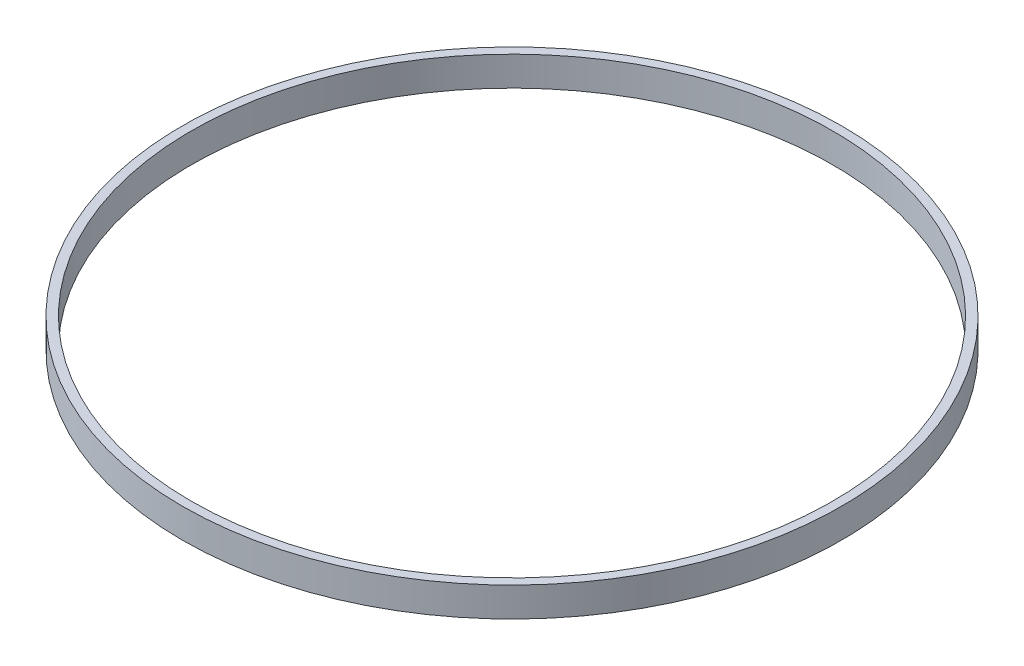
ISO-10303-21;
HEADER;
FILE_DESCRIPTION(('STEP AP214'),'2;1');
FILE_NAME('part.step','',(''),(''),'','','');
FILE_SCHEMA(('AUTOMOTIVE_DESIGN { 1 0 10303 214 1 1 1 1 }'));
ENDSEC;
DATA;
#1=APPLICATION_CONTEXT('core data for automotive mechanical design processes');
#2=APPLICATION_PROTOCOL_DEFINITION('international standard','automotive_design',2000,#1);
#3=PRODUCT_CONTEXT('',#1,'mechanical');
#4=PRODUCT('Part','Part','',(#3));
#5=PRODUCT_RELATED_PRODUCT_CATEGORY('part','',(#4));
#6=PRODUCT_DEFINITION_FORMATION('','',#4);
#7=PRODUCT_DEFINITION_CONTEXT('part definition',#1,'design');
#8=PRODUCT_DEFINITION('design','',#6,#7);
#9=PRODUCT_DEFINITION_SHAPE('','',#8);
#10=(LENGTH_UNIT() NAMED_UNIT(*) SI_UNIT(.MILLI.,.METRE.));
#11=(NAMED_UNIT(*) PLANE_ANGLE_UNIT() SI_UNIT($,.RADIAN.));
#12=(NAMED_UNIT(*) SI_UNIT($,.STERADIAN.) SOLID_ANGLE_UNIT());
#13=UNCERTAINTY_MEASURE_WITH_UNIT(LENGTH_MEASURE(1.E-05),#10,'distance_accuracy_value','');
#14=(GEOMETRIC_REPRESENTATION_CONTEXT(3) GLOBAL_UNCERTAINTY_ASSIGNED_CONTEXT((#13)) GLOBAL_UNIT_ASSIGNED_CONTEXT((#10,
#11,#12)) REPRESENTATION_CONTEXT('',''));
#15=CARTESIAN_POINT('',(0.,0.,0.));
#16=DIRECTION('',(0.,0.,1.));
#17=DIRECTION('',(1.,0.,0.));
#18=AXIS2_PLACEMENT_3D('',#15,#16,#17);
#19=CARTESIAN_POINT('',(0.,2.5,0.));
#20=DIRECTION('',(0.,1.,0.));
#21=DIRECTION('',(0.,0.,1.));
#22=AXIS2_PLACEMENT_3D('',#19,#20,#21);
#23=PLANE('',#22);
#24=CARTESIAN_POINT('',(0.,2.5,0.));
#25=DIRECTION('',(0.,1.,0.));
#26=DIRECTION('',(0.,0.,1.));
#27=AXIS2_PLACEMENT_3D('',#24,#25,#26);
#28=CIRCLE('',#27,28.);
#29=CARTESIAN_POINT('',(0.,2.5,28.));
#30=VERTEX_POINT('',#29);
#31=EDGE_CURVE('E10',#30,#30,#28,.T.);
#32=ORIENTED_EDGE('',*,*,#31,.T.);
#33=EDGE_LOOP('',(#32));
#34=FACE_BOUND('',#33,.T.);
#35=CARTESIAN_POINT('',(0.,2.5,0.));
#36=DIRECTION('',(0.,1.,0.));
#37=DIRECTION('',(0.,0.,1.));
#38=AXIS2_PLACEMENT_3D('',#35,#36,#37);
#39=CIRCLE('',#38,27.25);
#40=CARTESIAN_POINT('',(0.,2.5,27.25));
#41=VERTEX_POINT('',#40);
#42=EDGE_CURVE('E42',#41,#41,#39,.T.);
#43=ORIENTED_EDGE('',*,*,#42,.F.);
#44=EDGE_LOOP('',(#43));
#45=FACE_BOUND('',#44,.T.);
#46=ADVANCED_FACE('F31',(#34,#45),#23,.T.);
#47=CARTESIAN_POINT('',(0.,0.,0.));
#48=DIRECTION('',(0.,1.,0.));
#49=DIRECTION('',(0.,0.,1.));
#50=AXIS2_PLACEMENT_3D('',#47,#48,#49);
#51=PLANE('',#50);
#52=CARTESIAN_POINT('',(0.,0.,0.));
#53=DIRECTION('',(0.,1.,0.));
#54=DIRECTION('',(0.,0.,1.));
#55=AXIS2_PLACEMENT_3D('',#52,#53,#54);
#56=CIRCLE('',#55,28.);
#57=CARTESIAN_POINT('',(0.,0.,28.));
#58=VERTEX_POINT('',#57);
#59=EDGE_CURVE('E35',#58,#58,#56,.T.);
#60=ORIENTED_EDGE('',*,*,#59,.F.);
#61=EDGE_LOOP('',(#60));
#62=FACE_BOUND('',#61,.T.);
#63=CARTESIAN_POINT('',(0.,0.,0.));
#64=DIRECTION('',(0.,1.,0.));
#65=DIRECTION('',(0.,0.,1.));
#66=AXIS2_PLACEMENT_3D('',#63,#64,#65);
#67=CIRCLE('',#66,27.25);
#68=CARTESIAN_POINT('',(0.,0.,27.25));
#69=VERTEX_POINT('',#68);
#70=EDGE_CURVE('E44',#69,#69,#67,.T.);
#71=ORIENTED_EDGE('',*,*,#70,.T.);
#72=EDGE_LOOP('',(#71));
#73=FACE_BOUND('',#72,.T.);
#74=ADVANCED_FACE('F54',(#62,#73),#51,.F.);
#75=CARTESIAN_POINT('',(0.,2.5,0.));
#76=DIRECTION('',(0.,-1.,0.));
#77=DIRECTION('',(0.,0.,-1.));
#78=AXIS2_PLACEMENT_3D('',#75,#76,#77);
#79=CYLINDRICAL_SURFACE('',#78,28.);
#80=ORIENTED_EDGE('',*,*,#31,.F.);
#81=EDGE_LOOP('',(#80));
#82=FACE_BOUND('',#81,.T.);
#83=ORIENTED_EDGE('',*,*,#59,.T.);
#84=EDGE_LOOP('',(#83));
#85=FACE_BOUND('',#84,.T.);
#86=ADVANCED_FACE('F33',(#82,#85),#79,.T.);
#87=CARTESIAN_POINT('',(0.,2.5,0.));
#88=DIRECTION('',(0.,-1.,0.));
#89=DIRECTION('',(0.,0.,-1.));
#90=AXIS2_PLACEMENT_3D('',#87,#88,#89);
#91=CYLINDRICAL_SURFACE('',#90,27.25);
#92=ORIENTED_EDGE('',*,*,#42,.T.);
#93=EDGE_LOOP('',(#92));
#94=FACE_BOUND('',#93,.T.);
#95=ORIENTED_EDGE('',*,*,#70,.F.);
#96=EDGE_LOOP('',(#95));
#97=FACE_BOUND('',#96,.T.);
#98=ADVANCED_FACE('F50',(#94,#97),#91,.F.);
#99=CLOSED_SHELL('',(#46,#74,#86,#98));
#100=MANIFOLD_SOLID_BREP('B2',#99);
#101=ADVANCED_BREP_SHAPE_REPRESENTATION('',(#18,#100),#14);
#102=SHAPE_DEFINITION_REPRESENTATION(#9,#101);
ENDSEC;
END-ISO-10303-21;
